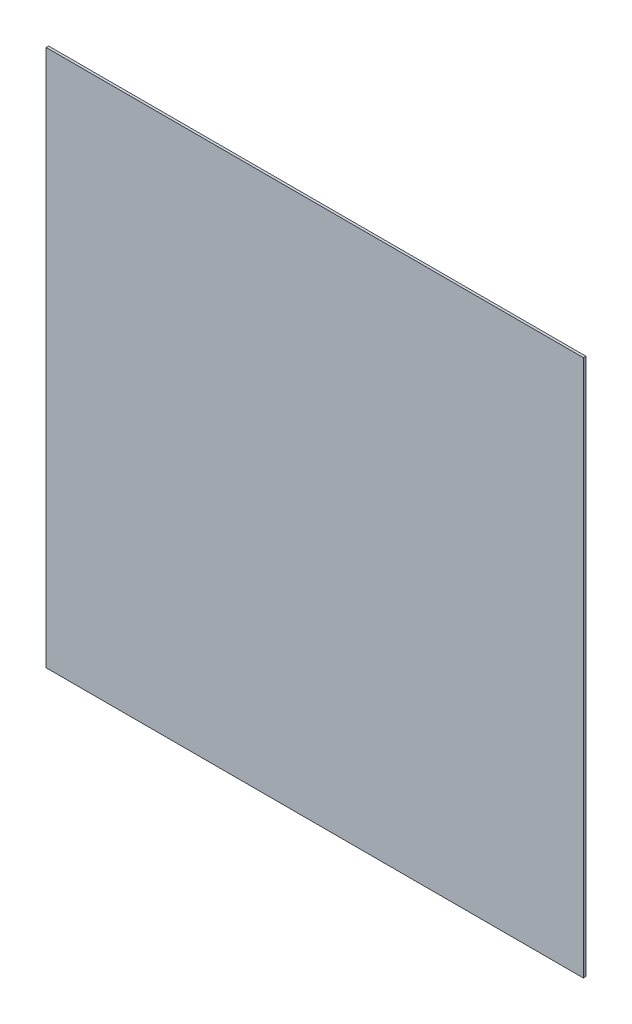
ISO-10303-21;
HEADER;
FILE_DESCRIPTION(('STEP AP214'),'2;1');
FILE_NAME('part.step','',(''),(''),'','','');
FILE_SCHEMA(('AUTOMOTIVE_DESIGN { 1 0 10303 214 1 1 1 1 }'));
ENDSEC;
DATA;
#1=APPLICATION_CONTEXT('core data for automotive mechanical design processes');
#2=APPLICATION_PROTOCOL_DEFINITION('international standard','automotive_design',2000,#1);
#3=PRODUCT_CONTEXT('',#1,'mechanical');
#4=PRODUCT('Part','Part','',(#3));
#5=PRODUCT_RELATED_PRODUCT_CATEGORY('part','',(#4));
#6=PRODUCT_DEFINITION_FORMATION('','',#4);
#7=PRODUCT_DEFINITION_CONTEXT('part definition',#1,'design');
#8=PRODUCT_DEFINITION('design','',#6,#7);
#9=PRODUCT_DEFINITION_SHAPE('','',#8);
#10=(LENGTH_UNIT() NAMED_UNIT(*) SI_UNIT(.MILLI.,.METRE.));
#11=(NAMED_UNIT(*) PLANE_ANGLE_UNIT() SI_UNIT($,.RADIAN.));
#12=(NAMED_UNIT(*) SI_UNIT($,.STERADIAN.) SOLID_ANGLE_UNIT());
#13=UNCERTAINTY_MEASURE_WITH_UNIT(LENGTH_MEASURE(1.E-05),#10,'distance_accuracy_value','');
#14=(GEOMETRIC_REPRESENTATION_CONTEXT(3) GLOBAL_UNCERTAINTY_ASSIGNED_CONTEXT((#13)) GLOBAL_UNIT_ASSIGNED_CONTEXT((#10,
#11,#12)) REPRESENTATION_CONTEXT('',''));
#15=CARTESIAN_POINT('',(0.,0.,0.));
#16=DIRECTION('',(0.,0.,1.));
#17=DIRECTION('',(1.,0.,0.));
#18=AXIS2_PLACEMENT_3D('',#15,#16,#17);
#19=CARTESIAN_POINT('',(0.,0.,3.));
#20=DIRECTION('',(-1.,0.,0.));
#21=DIRECTION('',(0.,-1.,0.));
#22=AXIS2_PLACEMENT_3D('',#19,#20,#21);
#23=PLANE('',#22);
#24=DIRECTION('',(0.,1.,0.));
#25=VECTOR('',#24,1.);
#26=CARTESIAN_POINT('',(0.,0.,0.));
#27=LINE('',#26,#25);
#28=CARTESIAN_POINT('',(0.,0.,0.));
#29=VERTEX_POINT('',#28);
#30=CARTESIAN_POINT('',(-1.11022302462516E-13,640.,0.));
#31=VERTEX_POINT('',#30);
#32=EDGE_CURVE('E96',#29,#31,#27,.T.);
#33=ORIENTED_EDGE('',*,*,#32,.T.);
#34=DIRECTION('',(0.,0.,-1.));
#35=VECTOR('',#34,1.);
#36=CARTESIAN_POINT('',(-1.11022302462516E-13,640.,3.));
#37=LINE('',#36,#35);
#38=CARTESIAN_POINT('',(-1.11022302462516E-13,640.,3.));
#39=VERTEX_POINT('',#38);
#40=EDGE_CURVE('E11',#39,#31,#37,.T.);
#41=ORIENTED_EDGE('',*,*,#40,.F.);
#42=DIRECTION('',(0.,1.,0.));
#43=VECTOR('',#42,1.);
#44=CARTESIAN_POINT('',(0.,0.,3.));
#45=LINE('',#44,#43);
#46=CARTESIAN_POINT('',(0.,0.,3.));
#47=VERTEX_POINT('',#46);
#48=EDGE_CURVE('E84',#47,#39,#45,.T.);
#49=ORIENTED_EDGE('',*,*,#48,.F.);
#50=DIRECTION('',(0.,0.,-1.));
#51=VECTOR('',#50,1.);
#52=CARTESIAN_POINT('',(0.,0.,3.));
#53=LINE('',#52,#51);
#54=EDGE_CURVE('E92',#47,#29,#53,.T.);
#55=ORIENTED_EDGE('',*,*,#54,.T.);
#56=EDGE_LOOP('',(#33,#41,#49,#55));
#57=FACE_BOUND('',#56,.T.);
#58=ADVANCED_FACE('F33',(#57),#23,.F.);
#59=CARTESIAN_POINT('',(-1.11022302462516E-13,640.,3.));
#60=DIRECTION('',(0.,-1.,0.));
#61=DIRECTION('',(1.,0.,0.));
#62=AXIS2_PLACEMENT_3D('',#59,#60,#61);
#63=PLANE('',#62);
#64=DIRECTION('',(-1.,0.,0.));
#65=VECTOR('',#64,1.);
#66=CARTESIAN_POINT('',(-1.11022302462516E-13,640.,0.));
#67=LINE('',#66,#65);
#68=CARTESIAN_POINT('',(-640.,640.,0.));
#69=VERTEX_POINT('',#68);
#70=EDGE_CURVE('E88',#31,#69,#67,.T.);
#71=ORIENTED_EDGE('',*,*,#70,.T.);
#72=DIRECTION('',(0.,0.,-1.));
#73=VECTOR('',#72,1.);
#74=CARTESIAN_POINT('',(-640.,640.,3.));
#75=LINE('',#74,#73);
#76=CARTESIAN_POINT('',(-640.,640.,3.));
#77=VERTEX_POINT('',#76);
#78=EDGE_CURVE('E41',#77,#69,#75,.T.);
#79=ORIENTED_EDGE('',*,*,#78,.F.);
#80=DIRECTION('',(-1.,0.,0.));
#81=VECTOR('',#80,1.);
#82=CARTESIAN_POINT('',(-1.11022302462516E-13,640.,3.));
#83=LINE('',#82,#81);
#84=EDGE_CURVE('E79',#39,#77,#83,.T.);
#85=ORIENTED_EDGE('',*,*,#84,.F.);
#86=ORIENTED_EDGE('',*,*,#40,.T.);
#87=EDGE_LOOP('',(#71,#79,#85,#86));
#88=FACE_BOUND('',#87,.T.);
#89=ADVANCED_FACE('F87',(#88),#63,.F.);
#90=CARTESIAN_POINT('',(-640.,0.,3.));
#91=DIRECTION('',(1.,0.,0.));
#92=DIRECTION('',(0.,1.,0.));
#93=AXIS2_PLACEMENT_3D('',#90,#91,#92);
#94=PLANE('',#93);
#95=DIRECTION('',(0.,-1.,0.));
#96=VECTOR('',#95,1.);
#97=CARTESIAN_POINT('',(-640.,0.,0.));
#98=LINE('',#97,#96);
#99=CARTESIAN_POINT('',(-640.,0.,0.));
#100=VERTEX_POINT('',#99);
#101=EDGE_CURVE('E66',#69,#100,#98,.T.);
#102=ORIENTED_EDGE('',*,*,#101,.T.);
#103=DIRECTION('',(0.,0.,-1.));
#104=VECTOR('',#103,1.);
#105=CARTESIAN_POINT('',(-640.,0.,3.));
#106=LINE('',#105,#104);
#107=CARTESIAN_POINT('',(-640.,0.,3.));
#108=VERTEX_POINT('',#107);
#109=EDGE_CURVE('E89',#108,#100,#106,.T.);
#110=ORIENTED_EDGE('',*,*,#109,.F.);
#111=DIRECTION('',(0.,-1.,0.));
#112=VECTOR('',#111,1.);
#113=CARTESIAN_POINT('',(-640.,0.,3.));
#114=LINE('',#113,#112);
#115=EDGE_CURVE('E82',#77,#108,#114,.T.);
#116=ORIENTED_EDGE('',*,*,#115,.F.);
#117=ORIENTED_EDGE('',*,*,#78,.T.);
#118=EDGE_LOOP('',(#102,#110,#116,#117));
#119=FACE_BOUND('',#118,.T.);
#120=ADVANCED_FACE('F90',(#119),#94,.F.);
#121=CARTESIAN_POINT('',(0.,0.,3.));
#122=DIRECTION('',(0.,1.,0.));
#123=DIRECTION('',(-1.,0.,0.));
#124=AXIS2_PLACEMENT_3D('',#121,#122,#123);
#125=PLANE('',#124);
#126=DIRECTION('',(1.,0.,0.));
#127=VECTOR('',#126,1.);
#128=CARTESIAN_POINT('',(0.,0.,0.));
#129=LINE('',#128,#127);
#130=EDGE_CURVE('E72',#100,#29,#129,.T.);
#131=ORIENTED_EDGE('',*,*,#130,.T.);
#132=ORIENTED_EDGE('',*,*,#54,.F.);
#133=DIRECTION('',(1.,0.,0.));
#134=VECTOR('',#133,1.);
#135=CARTESIAN_POINT('',(0.,0.,3.));
#136=LINE('',#135,#134);
#137=EDGE_CURVE('E49',#108,#47,#136,.T.);
#138=ORIENTED_EDGE('',*,*,#137,.F.);
#139=ORIENTED_EDGE('',*,*,#109,.T.);
#140=EDGE_LOOP('',(#131,#132,#138,#139));
#141=FACE_BOUND('',#140,.T.);
#142=ADVANCED_FACE('F103',(#141),#125,.F.);
#143=CARTESIAN_POINT('',(-1.11022302462516E-13,640.,3.));
#144=DIRECTION('',(0.,0.,1.));
#145=DIRECTION('',(1.,0.,0.));
#146=AXIS2_PLACEMENT_3D('',#143,#144,#145);
#147=PLANE('',#146);
#148=ORIENTED_EDGE('',*,*,#48,.T.);
#149=ORIENTED_EDGE('',*,*,#84,.T.);
#150=ORIENTED_EDGE('',*,*,#115,.T.);
#151=ORIENTED_EDGE('',*,*,#137,.T.);
#152=EDGE_LOOP('',(#148,#149,#150,#151));
#153=FACE_BOUND('',#152,.T.);
#154=ADVANCED_FACE('F80',(#153),#147,.T.);
#155=CARTESIAN_POINT('',(-1.11022302462516E-13,640.,0.));
#156=DIRECTION('',(0.,0.,1.));
#157=DIRECTION('',(1.,0.,0.));
#158=AXIS2_PLACEMENT_3D('',#155,#156,#157);
#159=PLANE('',#158);
#160=ORIENTED_EDGE('',*,*,#32,.F.);
#161=ORIENTED_EDGE('',*,*,#130,.F.);
#162=ORIENTED_EDGE('',*,*,#101,.F.);
#163=ORIENTED_EDGE('',*,*,#70,.F.);
#164=EDGE_LOOP('',(#160,#161,#162,#163));
#165=FACE_BOUND('',#164,.T.);
#166=ADVANCED_FACE('F106',(#165),#159,.F.);
#167=CLOSED_SHELL('',(#58,#89,#120,#142,#154,#166));
#168=MANIFOLD_SOLID_BREP('B2',#167);
#169=ADVANCED_BREP_SHAPE_REPRESENTATION('',(#18,#168),#14);
#170=SHAPE_DEFINITION_REPRESENTATION(#9,#169);
ENDSEC;
END-ISO-10303-21;
